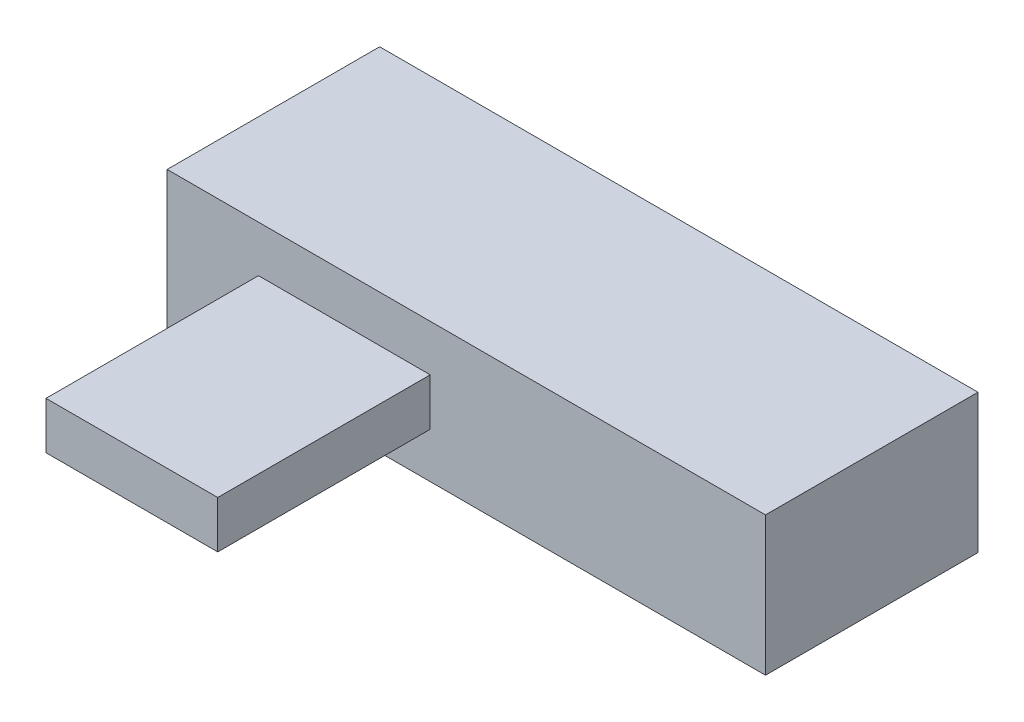
ISO-10303-21;
HEADER;
FILE_DESCRIPTION(('STEP AP214'),'2;1');
FILE_NAME('part.step','',(''),(''),'','','');
FILE_SCHEMA(('AUTOMOTIVE_DESIGN { 1 0 10303 214 1 1 1 1 }'));
ENDSEC;
DATA;
#1=APPLICATION_CONTEXT('core data for automotive mechanical design processes');
#2=APPLICATION_PROTOCOL_DEFINITION('international standard','automotive_design',2000,#1);
#3=PRODUCT_CONTEXT('',#1,'mechanical');
#4=PRODUCT('Part','Part','',(#3));
#5=PRODUCT_RELATED_PRODUCT_CATEGORY('part','',(#4));
#6=PRODUCT_DEFINITION_FORMATION('','',#4);
#7=PRODUCT_DEFINITION_CONTEXT('part definition',#1,'design');
#8=PRODUCT_DEFINITION('design','',#6,#7);
#9=PRODUCT_DEFINITION_SHAPE('','',#8);
#10=(LENGTH_UNIT() NAMED_UNIT(*) SI_UNIT(.MILLI.,.METRE.));
#11=(NAMED_UNIT(*) PLANE_ANGLE_UNIT() SI_UNIT($,.RADIAN.));
#12=(NAMED_UNIT(*) SI_UNIT($,.STERADIAN.) SOLID_ANGLE_UNIT());
#13=UNCERTAINTY_MEASURE_WITH_UNIT(LENGTH_MEASURE(1.E-05),#10,'distance_accuracy_value','');
#14=(GEOMETRIC_REPRESENTATION_CONTEXT(3) GLOBAL_UNCERTAINTY_ASSIGNED_CONTEXT((#13)) GLOBAL_UNIT_ASSIGNED_CONTEXT((#10,
#11,#12)) REPRESENTATION_CONTEXT('',''));
#15=CARTESIAN_POINT('',(0.,0.,0.));
#16=DIRECTION('',(0.,0.,1.));
#17=DIRECTION('',(1.,0.,0.));
#18=AXIS2_PLACEMENT_3D('',#15,#16,#17);
#19=CARTESIAN_POINT('',(0.,0.,63.));
#20=DIRECTION('',(0.,0.,1.));
#21=DIRECTION('',(1.,0.,0.));
#22=AXIS2_PLACEMENT_3D('',#19,#20,#21);
#23=PLANE('',#22);
#24=DIRECTION('',(0.,-1.,0.));
#25=VECTOR('',#24,1.);
#26=CARTESIAN_POINT('',(-65.2319115777357,21.7439705259119,63.));
#27=LINE('',#26,#25);
#28=CARTESIAN_POINT('',(-65.2319115777357,21.7439705259119,63.));
#29=VERTEX_POINT('',#28);
#30=CARTESIAN_POINT('',(-65.2319115777357,-19.4348763107708,63.));
#31=VERTEX_POINT('',#30);
#32=EDGE_CURVE('E145',#29,#31,#27,.T.);
#33=ORIENTED_EDGE('',*,*,#32,.T.);
#34=DIRECTION('',(1.,0.,0.));
#35=VECTOR('',#34,1.);
#36=CARTESIAN_POINT('',(-65.2319115777357,-19.4348763107708,63.));
#37=LINE('',#36,#35);
#38=CARTESIAN_POINT('',(112.183493952271,-19.4348763107708,63.));
#39=VERTEX_POINT('',#38);
#40=EDGE_CURVE('E90',#31,#39,#37,.T.);
#41=ORIENTED_EDGE('',*,*,#40,.T.);
#42=DIRECTION('',(0.,1.,0.));
#43=VECTOR('',#42,1.);
#44=CARTESIAN_POINT('',(112.183493952271,21.7439705259119,63.));
#45=LINE('',#44,#43);
#46=CARTESIAN_POINT('',(112.183493952271,21.7439705259119,63.));
#47=VERTEX_POINT('',#46);
#48=EDGE_CURVE('E148',#39,#47,#45,.T.);
#49=ORIENTED_EDGE('',*,*,#48,.T.);
#50=DIRECTION('',(-1.,0.,0.));
#51=VECTOR('',#50,1.);
#52=CARTESIAN_POINT('',(-65.2319115777357,21.7439705259119,63.));
#53=LINE('',#52,#51);
#54=EDGE_CURVE('E62',#47,#29,#53,.T.);
#55=ORIENTED_EDGE('',*,*,#54,.T.);
#56=EDGE_LOOP('',(#33,#41,#49,#55));
#57=FACE_BOUND('',#56,.T.);
#58=DIRECTION('',(1.,0.,0.));
#59=VECTOR('',#58,1.);
#60=CARTESIAN_POINT('',(-38.1621628404787,-5.98440566236036,63.));
#61=LINE('',#60,#59);
#62=CARTESIAN_POINT('',(-38.1621628404787,-5.98440566236036,63.));
#63=VERTEX_POINT('',#62);
#64=CARTESIAN_POINT('',(12.762751735977,-5.98440566236036,63.));
#65=VERTEX_POINT('',#64);
#66=EDGE_CURVE('E272',#63,#65,#61,.T.);
#67=ORIENTED_EDGE('',*,*,#66,.F.);
#68=DIRECTION('',(0.,-1.,0.));
#69=VECTOR('',#68,1.);
#70=CARTESIAN_POINT('',(-38.1621628404787,7.99997210486936,63.));
#71=LINE('',#70,#69);
#72=CARTESIAN_POINT('',(-38.1621628404787,7.99997210486936,63.));
#73=VERTEX_POINT('',#72);
#74=EDGE_CURVE('E135',#73,#63,#71,.T.);
#75=ORIENTED_EDGE('',*,*,#74,.F.);
#76=DIRECTION('',(-1.,0.,0.));
#77=VECTOR('',#76,1.);
#78=CARTESIAN_POINT('',(-38.1621628404787,7.99997210486936,63.));
#79=LINE('',#78,#77);
#80=CARTESIAN_POINT('',(12.762751735977,7.99997210486936,63.));
#81=VERTEX_POINT('',#80);
#82=EDGE_CURVE('E131',#81,#73,#79,.T.);
#83=ORIENTED_EDGE('',*,*,#82,.F.);
#84=DIRECTION('',(0.,1.,0.));
#85=VECTOR('',#84,1.);
#86=CARTESIAN_POINT('',(12.762751735977,7.99997210486936,63.));
#87=LINE('',#86,#85);
#88=EDGE_CURVE('E269',#65,#81,#87,.T.);
#89=ORIENTED_EDGE('',*,*,#88,.F.);
#90=EDGE_LOOP('',(#67,#75,#83,#89));
#91=FACE_BOUND('',#90,.T.);
#92=ADVANCED_FACE('F38',(#57,#91),#23,.T.);
#93=CARTESIAN_POINT('',(-65.2319115777357,21.7439705259119,63.));
#94=DIRECTION('',(1.,0.,0.));
#95=DIRECTION('',(0.,0.,-1.));
#96=AXIS2_PLACEMENT_3D('',#93,#94,#95);
#97=PLANE('',#96);
#98=DIRECTION('',(0.,-1.,0.));
#99=VECTOR('',#98,1.);
#100=CARTESIAN_POINT('',(-65.2319115777357,21.7439705259119,0.));
#101=LINE('',#100,#99);
#102=CARTESIAN_POINT('',(-65.2319115777357,21.7439705259119,0.));
#103=VERTEX_POINT('',#102);
#104=CARTESIAN_POINT('',(-65.2319115777357,-19.4348763107708,0.));
#105=VERTEX_POINT('',#104);
#106=EDGE_CURVE('E137',#103,#105,#101,.T.);
#107=ORIENTED_EDGE('',*,*,#106,.T.);
#108=DIRECTION('',(0.,0.,-1.));
#109=VECTOR('',#108,1.);
#110=CARTESIAN_POINT('',(-65.2319115777357,-19.4348763107708,63.));
#111=LINE('',#110,#109);
#112=EDGE_CURVE('E11',#31,#105,#111,.T.);
#113=ORIENTED_EDGE('',*,*,#112,.F.);
#114=ORIENTED_EDGE('',*,*,#32,.F.);
#115=DIRECTION('',(0.,0.,-1.));
#116=VECTOR('',#115,1.);
#117=CARTESIAN_POINT('',(-65.2319115777357,21.7439705259119,63.));
#118=LINE('',#117,#116);
#119=EDGE_CURVE('E150',#29,#103,#118,.T.);
#120=ORIENTED_EDGE('',*,*,#119,.T.);
#121=EDGE_LOOP('',(#107,#113,#114,#120));
#122=FACE_BOUND('',#121,.T.);
#123=ADVANCED_FACE('F40',(#122),#97,.F.);
#124=CARTESIAN_POINT('',(-65.2319115777357,-19.4348763107708,63.));
#125=DIRECTION('',(0.,1.,0.));
#126=DIRECTION('',(0.,0.,1.));
#127=AXIS2_PLACEMENT_3D('',#124,#125,#126);
#128=PLANE('',#127);
#129=DIRECTION('',(1.,0.,0.));
#130=VECTOR('',#129,1.);
#131=CARTESIAN_POINT('',(-65.2319115777357,-19.4348763107708,0.));
#132=LINE('',#131,#130);
#133=CARTESIAN_POINT('',(112.183493952271,-19.4348763107708,0.));
#134=VERTEX_POINT('',#133);
#135=EDGE_CURVE('E140',#105,#134,#132,.T.);
#136=ORIENTED_EDGE('',*,*,#135,.T.);
#137=DIRECTION('',(0.,0.,-1.));
#138=VECTOR('',#137,1.);
#139=CARTESIAN_POINT('',(112.183493952271,-19.4348763107708,63.));
#140=LINE('',#139,#138);
#141=EDGE_CURVE('E46',#39,#134,#140,.T.);
#142=ORIENTED_EDGE('',*,*,#141,.F.);
#143=ORIENTED_EDGE('',*,*,#40,.F.);
#144=ORIENTED_EDGE('',*,*,#112,.T.);
#145=EDGE_LOOP('',(#136,#142,#143,#144));
#146=FACE_BOUND('',#145,.T.);
#147=ADVANCED_FACE('F178',(#146),#128,.F.);
#148=CARTESIAN_POINT('',(112.183493952271,21.7439705259119,63.));
#149=DIRECTION('',(-1.,0.,0.));
#150=DIRECTION('',(0.,0.,1.));
#151=AXIS2_PLACEMENT_3D('',#148,#149,#150);
#152=PLANE('',#151);
#153=DIRECTION('',(0.,1.,0.));
#154=VECTOR('',#153,1.);
#155=CARTESIAN_POINT('',(112.183493952271,21.7439705259119,0.));
#156=LINE('',#155,#154);
#157=CARTESIAN_POINT('',(112.183493952271,21.7439705259119,0.));
#158=VERTEX_POINT('',#157);
#159=EDGE_CURVE('E153',#134,#158,#156,.T.);
#160=ORIENTED_EDGE('',*,*,#159,.T.);
#161=DIRECTION('',(0.,0.,-1.));
#162=VECTOR('',#161,1.);
#163=CARTESIAN_POINT('',(112.183493952271,21.7439705259119,63.));
#164=LINE('',#163,#162);
#165=EDGE_CURVE('E157',#47,#158,#164,.T.);
#166=ORIENTED_EDGE('',*,*,#165,.F.);
#167=ORIENTED_EDGE('',*,*,#48,.F.);
#168=ORIENTED_EDGE('',*,*,#141,.T.);
#169=EDGE_LOOP('',(#160,#166,#167,#168));
#170=FACE_BOUND('',#169,.T.);
#171=ADVANCED_FACE('F162',(#170),#152,.F.);
#172=CARTESIAN_POINT('',(-65.2319115777357,21.7439705259119,63.));
#173=DIRECTION('',(0.,-1.,0.));
#174=DIRECTION('',(0.,0.,-1.));
#175=AXIS2_PLACEMENT_3D('',#172,#173,#174);
#176=PLANE('',#175);
#177=DIRECTION('',(-1.,0.,0.));
#178=VECTOR('',#177,1.);
#179=CARTESIAN_POINT('',(-65.2319115777357,21.7439705259119,0.));
#180=LINE('',#179,#178);
#181=EDGE_CURVE('E83',#158,#103,#180,.T.);
#182=ORIENTED_EDGE('',*,*,#181,.T.);
#183=ORIENTED_EDGE('',*,*,#119,.F.);
#184=ORIENTED_EDGE('',*,*,#54,.F.);
#185=ORIENTED_EDGE('',*,*,#165,.T.);
#186=EDGE_LOOP('',(#182,#183,#184,#185));
#187=FACE_BOUND('',#186,.T.);
#188=ADVANCED_FACE('F170',(#187),#176,.F.);
#189=CARTESIAN_POINT('',(0.,0.,0.));
#190=DIRECTION('',(0.,0.,1.));
#191=DIRECTION('',(1.,0.,0.));
#192=AXIS2_PLACEMENT_3D('',#189,#190,#191);
#193=PLANE('',#192);
#194=ORIENTED_EDGE('',*,*,#106,.F.);
#195=ORIENTED_EDGE('',*,*,#181,.F.);
#196=ORIENTED_EDGE('',*,*,#159,.F.);
#197=ORIENTED_EDGE('',*,*,#135,.F.);
#198=EDGE_LOOP('',(#194,#195,#196,#197));
#199=FACE_BOUND('',#198,.T.);
#200=ADVANCED_FACE('F166',(#199),#193,.F.);
#201=CARTESIAN_POINT('',(-38.1621628404787,7.99997210486936,126.));
#202=DIRECTION('',(1.,0.,0.));
#203=DIRECTION('',(0.,0.,-1.));
#204=AXIS2_PLACEMENT_3D('',#201,#202,#203);
#205=PLANE('',#204);
#206=ORIENTED_EDGE('',*,*,#74,.T.);
#207=DIRECTION('',(0.,0.,-1.));
#208=VECTOR('',#207,1.);
#209=CARTESIAN_POINT('',(-38.1621628404787,-5.98440566236036,126.));
#210=LINE('',#209,#208);
#211=CARTESIAN_POINT('',(-38.1621628404787,-5.98440566236036,126.));
#212=VERTEX_POINT('',#211);
#213=EDGE_CURVE('E116',#212,#63,#210,.T.);
#214=ORIENTED_EDGE('',*,*,#213,.F.);
#215=DIRECTION('',(0.,-1.,0.));
#216=VECTOR('',#215,1.);
#217=CARTESIAN_POINT('',(-38.1621628404787,7.99997210486936,126.));
#218=LINE('',#217,#216);
#219=CARTESIAN_POINT('',(-38.1621628404787,7.99997210486936,126.));
#220=VERTEX_POINT('',#219);
#221=EDGE_CURVE('E123',#220,#212,#218,.T.);
#222=ORIENTED_EDGE('',*,*,#221,.F.);
#223=DIRECTION('',(0.,0.,-1.));
#224=VECTOR('',#223,1.);
#225=CARTESIAN_POINT('',(-38.1621628404787,7.99997210486936,126.));
#226=LINE('',#225,#224);
#227=EDGE_CURVE('E267',#220,#73,#226,.T.);
#228=ORIENTED_EDGE('',*,*,#227,.T.);
#229=EDGE_LOOP('',(#206,#214,#222,#228));
#230=FACE_BOUND('',#229,.T.);
#231=ADVANCED_FACE('F133',(#230),#205,.F.);
#232=CARTESIAN_POINT('',(-38.1621628404787,-5.98440566236036,126.));
#233=DIRECTION('',(0.,1.,0.));
#234=DIRECTION('',(0.,0.,1.));
#235=AXIS2_PLACEMENT_3D('',#232,#233,#234);
#236=PLANE('',#235);
#237=ORIENTED_EDGE('',*,*,#66,.T.);
#238=DIRECTION('',(0.,0.,-1.));
#239=VECTOR('',#238,1.);
#240=CARTESIAN_POINT('',(12.762751735977,-5.98440566236036,126.));
#241=LINE('',#240,#239);
#242=CARTESIAN_POINT('',(12.762751735977,-5.98440566236036,126.));
#243=VERTEX_POINT('',#242);
#244=EDGE_CURVE('E119',#243,#65,#241,.T.);
#245=ORIENTED_EDGE('',*,*,#244,.F.);
#246=DIRECTION('',(1.,0.,0.));
#247=VECTOR('',#246,1.);
#248=CARTESIAN_POINT('',(-38.1621628404787,-5.98440566236036,126.));
#249=LINE('',#248,#247);
#250=EDGE_CURVE('E112',#212,#243,#249,.T.);
#251=ORIENTED_EDGE('',*,*,#250,.F.);
#252=ORIENTED_EDGE('',*,*,#213,.T.);
#253=EDGE_LOOP('',(#237,#245,#251,#252));
#254=FACE_BOUND('',#253,.T.);
#255=ADVANCED_FACE('F114',(#254),#236,.F.);
#256=CARTESIAN_POINT('',(12.762751735977,7.99997210486936,126.));
#257=DIRECTION('',(-1.,0.,0.));
#258=DIRECTION('',(0.,0.,1.));
#259=AXIS2_PLACEMENT_3D('',#256,#257,#258);
#260=PLANE('',#259);
#261=ORIENTED_EDGE('',*,*,#88,.T.);
#262=DIRECTION('',(0.,0.,-1.));
#263=VECTOR('',#262,1.);
#264=CARTESIAN_POINT('',(12.762751735977,7.99997210486936,126.));
#265=LINE('',#264,#263);
#266=CARTESIAN_POINT('',(12.762751735977,7.99997210486936,126.));
#267=VERTEX_POINT('',#266);
#268=EDGE_CURVE('E53',#267,#81,#265,.T.);
#269=ORIENTED_EDGE('',*,*,#268,.F.);
#270=DIRECTION('',(0.,1.,0.));
#271=VECTOR('',#270,1.);
#272=CARTESIAN_POINT('',(12.762751735977,7.99997210486936,126.));
#273=LINE('',#272,#271);
#274=EDGE_CURVE('E122',#243,#267,#273,.T.);
#275=ORIENTED_EDGE('',*,*,#274,.F.);
#276=ORIENTED_EDGE('',*,*,#244,.T.);
#277=EDGE_LOOP('',(#261,#269,#275,#276));
#278=FACE_BOUND('',#277,.T.);
#279=ADVANCED_FACE('F191',(#278),#260,.F.);
#280=CARTESIAN_POINT('',(-38.1621628404787,7.99997210486936,126.));
#281=DIRECTION('',(0.,-1.,0.));
#282=DIRECTION('',(0.,0.,-1.));
#283=AXIS2_PLACEMENT_3D('',#280,#281,#282);
#284=PLANE('',#283);
#285=ORIENTED_EDGE('',*,*,#82,.T.);
#286=ORIENTED_EDGE('',*,*,#227,.F.);
#287=DIRECTION('',(-1.,0.,0.));
#288=VECTOR('',#287,1.);
#289=CARTESIAN_POINT('',(-38.1621628404787,7.99997210486936,126.));
#290=LINE('',#289,#288);
#291=EDGE_CURVE('E127',#267,#220,#290,.T.);
#292=ORIENTED_EDGE('',*,*,#291,.F.);
#293=ORIENTED_EDGE('',*,*,#268,.T.);
#294=EDGE_LOOP('',(#285,#286,#292,#293));
#295=FACE_BOUND('',#294,.T.);
#296=ADVANCED_FACE('F194',(#295),#284,.F.);
#297=CARTESIAN_POINT('',(0.,0.,126.));
#298=DIRECTION('',(0.,0.,1.));
#299=DIRECTION('',(1.,0.,0.));
#300=AXIS2_PLACEMENT_3D('',#297,#298,#299);
#301=PLANE('',#300);
#302=ORIENTED_EDGE('',*,*,#221,.T.);
#303=ORIENTED_EDGE('',*,*,#250,.T.);
#304=ORIENTED_EDGE('',*,*,#274,.T.);
#305=ORIENTED_EDGE('',*,*,#291,.T.);
#306=EDGE_LOOP('',(#302,#303,#304,#305));
#307=FACE_BOUND('',#306,.T.);
#308=ADVANCED_FACE('F126',(#307),#301,.T.);
#309=CLOSED_SHELL('',(#92,#123,#147,#171,#188,#200,#231,#255,#279,#296,#308));
#310=MANIFOLD_SOLID_BREP('B2',#309);
#311=ADVANCED_BREP_SHAPE_REPRESENTATION('',(#18,#310),#14);
#312=SHAPE_DEFINITION_REPRESENTATION(#9,#311);
ENDSEC;
END-ISO-10303-21;
